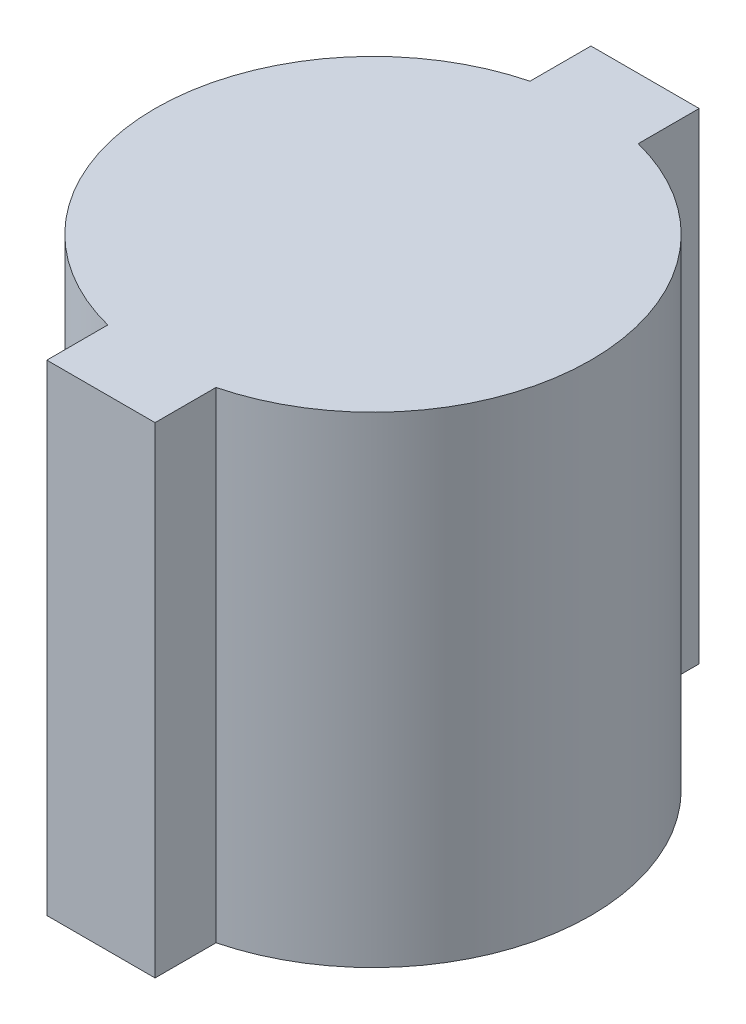
ISO-10303-21;
HEADER;
FILE_DESCRIPTION(('STEP AP214'),'2;1');
FILE_NAME('part.step','',(''),(''),'','','');
FILE_SCHEMA(('AUTOMOTIVE_DESIGN { 1 0 10303 214 1 1 1 1 }'));
ENDSEC;
DATA;
#1=APPLICATION_CONTEXT('core data for automotive mechanical design processes');
#2=APPLICATION_PROTOCOL_DEFINITION('international standard','automotive_design',2000,#1);
#3=PRODUCT_CONTEXT('',#1,'mechanical');
#4=PRODUCT('Part','Part','',(#3));
#5=PRODUCT_RELATED_PRODUCT_CATEGORY('part','',(#4));
#6=PRODUCT_DEFINITION_FORMATION('','',#4);
#7=PRODUCT_DEFINITION_CONTEXT('part definition',#1,'design');
#8=PRODUCT_DEFINITION('design','',#6,#7);
#9=PRODUCT_DEFINITION_SHAPE('','',#8);
#10=(LENGTH_UNIT() NAMED_UNIT(*) SI_UNIT(.MILLI.,.METRE.));
#11=(NAMED_UNIT(*) PLANE_ANGLE_UNIT() SI_UNIT($,.RADIAN.));
#12=(NAMED_UNIT(*) SI_UNIT($,.STERADIAN.) SOLID_ANGLE_UNIT());
#13=UNCERTAINTY_MEASURE_WITH_UNIT(LENGTH_MEASURE(1.E-05),#10,'distance_accuracy_value','');
#14=(GEOMETRIC_REPRESENTATION_CONTEXT(3) GLOBAL_UNCERTAINTY_ASSIGNED_CONTEXT((#13)) GLOBAL_UNIT_ASSIGNED_CONTEXT((#10,
#11,#12)) REPRESENTATION_CONTEXT('',''));
#15=CARTESIAN_POINT('',(0.,0.,0.));
#16=DIRECTION('',(0.,0.,1.));
#17=DIRECTION('',(1.,0.,0.));
#18=AXIS2_PLACEMENT_3D('',#15,#16,#17);
#19=CARTESIAN_POINT('',(0.,20.32,0.));
#20=DIRECTION('',(0.,-1.,0.));
#21=DIRECTION('',(0.,0.,-1.));
#22=AXIS2_PLACEMENT_3D('',#19,#20,#21);
#23=CYLINDRICAL_SURFACE('',#22,9.2075);
#24=CARTESIAN_POINT('',(0.,0.,0.));
#25=DIRECTION('',(0.,1.,0.));
#26=DIRECTION('',(0.,0.,1.));
#27=AXIS2_PLACEMENT_3D('',#24,#25,#26);
#28=CIRCLE('',#27,9.2075);
#29=CARTESIAN_POINT('',(2.286,0.,8.9192073779008));
#30=VERTEX_POINT('',#29);
#31=CARTESIAN_POINT('',(2.286,0.,-8.9192073779008));
#32=VERTEX_POINT('',#31);
#33=EDGE_CURVE('E152',#30,#32,#28,.T.);
#34=ORIENTED_EDGE('',*,*,#33,.T.);
#35=DIRECTION('',(0.,-1.,0.));
#36=VECTOR('',#35,1.);
#37=CARTESIAN_POINT('',(2.286,20.32,-8.9192073779008));
#38=LINE('',#37,#36);
#39=CARTESIAN_POINT('',(2.286,20.32,-8.9192073779008));
#40=VERTEX_POINT('',#39);
#41=EDGE_CURVE('E11',#40,#32,#38,.T.);
#42=ORIENTED_EDGE('',*,*,#41,.F.);
#43=CARTESIAN_POINT('',(0.,20.32,0.));
#44=DIRECTION('',(0.,1.,0.));
#45=DIRECTION('',(0.,0.,1.));
#46=AXIS2_PLACEMENT_3D('',#43,#44,#45);
#47=CIRCLE('',#46,9.2075);
#48=CARTESIAN_POINT('',(2.286,20.32,8.9192073779008));
#49=VERTEX_POINT('',#48);
#50=EDGE_CURVE('E145',#49,#40,#47,.T.);
#51=ORIENTED_EDGE('',*,*,#50,.F.);
#52=DIRECTION('',(0.,-1.,0.));
#53=VECTOR('',#52,1.);
#54=CARTESIAN_POINT('',(2.286,20.32,8.9192073779008));
#55=LINE('',#54,#53);
#56=EDGE_CURVE('E151',#49,#30,#55,.T.);
#57=ORIENTED_EDGE('',*,*,#56,.T.);
#58=EDGE_LOOP('',(#34,#42,#51,#57));
#59=FACE_BOUND('',#58,.T.);
#60=ADVANCED_FACE('F45',(#59),#23,.T.);
#61=CARTESIAN_POINT('',(2.286,20.32,0.));
#62=DIRECTION('',(-1.,0.,0.));
#63=DIRECTION('',(0.,0.,1.));
#64=AXIS2_PLACEMENT_3D('',#61,#62,#63);
#65=PLANE('',#64);
#66=DIRECTION('',(0.,0.,-1.));
#67=VECTOR('',#66,1.);
#68=CARTESIAN_POINT('',(2.286,0.,0.));
#69=LINE('',#68,#67);
#70=CARTESIAN_POINT('',(2.286,0.,-11.4935));
#71=VERTEX_POINT('',#70);
#72=EDGE_CURVE('E156',#32,#71,#69,.T.);
#73=ORIENTED_EDGE('',*,*,#72,.T.);
#74=DIRECTION('',(0.,-1.,0.));
#75=VECTOR('',#74,1.);
#76=CARTESIAN_POINT('',(2.286,20.32,-11.4935));
#77=LINE('',#76,#75);
#78=CARTESIAN_POINT('',(2.286,20.32,-11.4935));
#79=VERTEX_POINT('',#78);
#80=EDGE_CURVE('E55',#79,#71,#77,.T.);
#81=ORIENTED_EDGE('',*,*,#80,.F.);
#82=DIRECTION('',(0.,0.,-1.));
#83=VECTOR('',#82,1.);
#84=CARTESIAN_POINT('',(2.286,20.32,0.));
#85=LINE('',#84,#83);
#86=EDGE_CURVE('E105',#40,#79,#85,.T.);
#87=ORIENTED_EDGE('',*,*,#86,.F.);
#88=ORIENTED_EDGE('',*,*,#41,.T.);
#89=EDGE_LOOP('',(#73,#81,#87,#88));
#90=FACE_BOUND('',#89,.T.);
#91=ADVANCED_FACE('F47',(#90),#65,.F.);
#92=CARTESIAN_POINT('',(0.,20.32,-11.4935));
#93=DIRECTION('',(0.,0.,-1.));
#94=DIRECTION('',(-1.,0.,0.));
#95=AXIS2_PLACEMENT_3D('',#92,#93,#94);
#96=PLANE('',#95);
#97=DIRECTION('',(1.,0.,0.));
#98=VECTOR('',#97,1.);
#99=CARTESIAN_POINT('',(0.,0.,-11.4935));
#100=LINE('',#99,#98);
#101=CARTESIAN_POINT('',(-2.286,0.,-11.4935));
#102=VERTEX_POINT('',#101);
#103=EDGE_CURVE('E161',#102,#71,#100,.T.);
#104=ORIENTED_EDGE('',*,*,#103,.F.);
#105=DIRECTION('',(0.,-1.,0.));
#106=VECTOR('',#105,1.);
#107=CARTESIAN_POINT('',(-2.286,20.32,-11.4935));
#108=LINE('',#107,#106);
#109=CARTESIAN_POINT('',(-2.286,20.32,-11.4935));
#110=VERTEX_POINT('',#109);
#111=EDGE_CURVE('E184',#110,#102,#108,.T.);
#112=ORIENTED_EDGE('',*,*,#111,.F.);
#113=DIRECTION('',(1.,0.,0.));
#114=VECTOR('',#113,1.);
#115=CARTESIAN_POINT('',(0.,20.32,-11.4935));
#116=LINE('',#115,#114);
#117=EDGE_CURVE('E192',#110,#79,#116,.T.);
#118=ORIENTED_EDGE('',*,*,#117,.T.);
#119=ORIENTED_EDGE('',*,*,#80,.T.);
#120=EDGE_LOOP('',(#104,#112,#118,#119));
#121=FACE_BOUND('',#120,.T.);
#122=ADVANCED_FACE('F190',(#121),#96,.T.);
#123=CARTESIAN_POINT('',(-2.286,20.32,0.));
#124=DIRECTION('',(-1.,0.,0.));
#125=DIRECTION('',(0.,0.,1.));
#126=AXIS2_PLACEMENT_3D('',#123,#124,#125);
#127=PLANE('',#126);
#128=DIRECTION('',(0.,0.,-1.));
#129=VECTOR('',#128,1.);
#130=CARTESIAN_POINT('',(-2.286,0.,0.));
#131=LINE('',#130,#129);
#132=CARTESIAN_POINT('',(-2.286,0.,-8.9192073779008));
#133=VERTEX_POINT('',#132);
#134=EDGE_CURVE('E165',#133,#102,#131,.T.);
#135=ORIENTED_EDGE('',*,*,#134,.F.);
#136=DIRECTION('',(0.,-1.,0.));
#137=VECTOR('',#136,1.);
#138=CARTESIAN_POINT('',(-2.286,20.32,-8.9192073779008));
#139=LINE('',#138,#137);
#140=CARTESIAN_POINT('',(-2.286,20.32,-8.9192073779008));
#141=VERTEX_POINT('',#140);
#142=EDGE_CURVE('E181',#141,#133,#139,.T.);
#143=ORIENTED_EDGE('',*,*,#142,.F.);
#144=DIRECTION('',(0.,0.,-1.));
#145=VECTOR('',#144,1.);
#146=CARTESIAN_POINT('',(-2.286,20.32,0.));
#147=LINE('',#146,#145);
#148=EDGE_CURVE('E143',#141,#110,#147,.T.);
#149=ORIENTED_EDGE('',*,*,#148,.T.);
#150=ORIENTED_EDGE('',*,*,#111,.T.);
#151=EDGE_LOOP('',(#135,#143,#149,#150));
#152=FACE_BOUND('',#151,.T.);
#153=ADVANCED_FACE('F201',(#152),#127,.T.);
#154=CARTESIAN_POINT('',(-2.286,0.,8.9192073779008));
#155=VERTEX_POINT('',#154);
#156=EDGE_CURVE('E157',#133,#155,#28,.T.);
#157=ORIENTED_EDGE('',*,*,#156,.T.);
#158=DIRECTION('',(0.,-1.,0.));
#159=VECTOR('',#158,1.);
#160=CARTESIAN_POINT('',(-2.286,20.32,8.9192073779008));
#161=LINE('',#160,#159);
#162=CARTESIAN_POINT('',(-2.286,20.32,8.9192073779008));
#163=VERTEX_POINT('',#162);
#164=EDGE_CURVE('E128',#163,#155,#161,.T.);
#165=ORIENTED_EDGE('',*,*,#164,.F.);
#166=EDGE_CURVE('E138',#141,#163,#47,.T.);
#167=ORIENTED_EDGE('',*,*,#166,.F.);
#168=ORIENTED_EDGE('',*,*,#142,.T.);
#169=EDGE_LOOP('',(#157,#165,#167,#168));
#170=FACE_BOUND('',#169,.T.);
#171=ADVANCED_FACE('F222',(#170),#23,.T.);
#172=CARTESIAN_POINT('',(-2.286,20.32,0.));
#173=DIRECTION('',(-1.,0.,0.));
#174=DIRECTION('',(0.,0.,1.));
#175=AXIS2_PLACEMENT_3D('',#172,#173,#174);
#176=PLANE('',#175);
#177=DIRECTION('',(0.,0.,-1.));
#178=VECTOR('',#177,1.);
#179=CARTESIAN_POINT('',(-2.286,0.,0.));
#180=LINE('',#179,#178);
#181=CARTESIAN_POINT('',(-2.286,0.,11.4935));
#182=VERTEX_POINT('',#181);
#183=EDGE_CURVE('E126',#182,#155,#180,.T.);
#184=ORIENTED_EDGE('',*,*,#183,.F.);
#185=DIRECTION('',(0.,-1.,0.));
#186=VECTOR('',#185,1.);
#187=CARTESIAN_POINT('',(-2.286,20.32,11.4935));
#188=LINE('',#187,#186);
#189=CARTESIAN_POINT('',(-2.286,20.32,11.4935));
#190=VERTEX_POINT('',#189);
#191=EDGE_CURVE('E120',#190,#182,#188,.T.);
#192=ORIENTED_EDGE('',*,*,#191,.F.);
#193=DIRECTION('',(0.,0.,-1.));
#194=VECTOR('',#193,1.);
#195=CARTESIAN_POINT('',(-2.286,20.32,0.));
#196=LINE('',#195,#194);
#197=EDGE_CURVE('E124',#190,#163,#196,.T.);
#198=ORIENTED_EDGE('',*,*,#197,.T.);
#199=ORIENTED_EDGE('',*,*,#164,.T.);
#200=EDGE_LOOP('',(#184,#192,#198,#199));
#201=FACE_BOUND('',#200,.T.);
#202=ADVANCED_FACE('F122',(#201),#176,.T.);
#203=CARTESIAN_POINT('',(0.,20.32,11.4935));
#204=DIRECTION('',(0.,0.,-1.));
#205=DIRECTION('',(-1.,0.,0.));
#206=AXIS2_PLACEMENT_3D('',#203,#204,#205);
#207=PLANE('',#206);
#208=DIRECTION('',(1.,0.,0.));
#209=VECTOR('',#208,1.);
#210=CARTESIAN_POINT('',(0.,0.,11.4935));
#211=LINE('',#210,#209);
#212=CARTESIAN_POINT('',(2.286,0.,11.4935));
#213=VERTEX_POINT('',#212);
#214=EDGE_CURVE('E91',#182,#213,#211,.T.);
#215=ORIENTED_EDGE('',*,*,#214,.T.);
#216=DIRECTION('',(0.,-1.,0.));
#217=VECTOR('',#216,1.);
#218=CARTESIAN_POINT('',(2.286,20.32,11.4935));
#219=LINE('',#218,#217);
#220=CARTESIAN_POINT('',(2.286,20.32,11.4935));
#221=VERTEX_POINT('',#220);
#222=EDGE_CURVE('E129',#221,#213,#219,.T.);
#223=ORIENTED_EDGE('',*,*,#222,.F.);
#224=DIRECTION('',(1.,0.,0.));
#225=VECTOR('',#224,1.);
#226=CARTESIAN_POINT('',(0.,20.32,11.4935));
#227=LINE('',#226,#225);
#228=EDGE_CURVE('E131',#190,#221,#227,.T.);
#229=ORIENTED_EDGE('',*,*,#228,.F.);
#230=ORIENTED_EDGE('',*,*,#191,.T.);
#231=EDGE_LOOP('',(#215,#223,#229,#230));
#232=FACE_BOUND('',#231,.T.);
#233=ADVANCED_FACE('F132',(#232),#207,.F.);
#234=CARTESIAN_POINT('',(2.286,20.32,0.));
#235=DIRECTION('',(-1.,0.,0.));
#236=DIRECTION('',(0.,0.,1.));
#237=AXIS2_PLACEMENT_3D('',#234,#235,#236);
#238=PLANE('',#237);
#239=DIRECTION('',(0.,0.,-1.));
#240=VECTOR('',#239,1.);
#241=CARTESIAN_POINT('',(2.286,0.,0.));
#242=LINE('',#241,#240);
#243=EDGE_CURVE('E97',#213,#30,#242,.T.);
#244=ORIENTED_EDGE('',*,*,#243,.T.);
#245=ORIENTED_EDGE('',*,*,#56,.F.);
#246=DIRECTION('',(0.,0.,-1.));
#247=VECTOR('',#246,1.);
#248=CARTESIAN_POINT('',(2.286,20.32,0.));
#249=LINE('',#248,#247);
#250=EDGE_CURVE('E63',#221,#49,#249,.T.);
#251=ORIENTED_EDGE('',*,*,#250,.F.);
#252=ORIENTED_EDGE('',*,*,#222,.T.);
#253=EDGE_LOOP('',(#244,#245,#251,#252));
#254=FACE_BOUND('',#253,.T.);
#255=ADVANCED_FACE('F210',(#254),#238,.F.);
#256=CARTESIAN_POINT('',(0.,20.32,0.));
#257=DIRECTION('',(0.,1.,0.));
#258=DIRECTION('',(0.,0.,1.));
#259=AXIS2_PLACEMENT_3D('',#256,#257,#258);
#260=PLANE('',#259);
#261=ORIENTED_EDGE('',*,*,#50,.T.);
#262=ORIENTED_EDGE('',*,*,#86,.T.);
#263=ORIENTED_EDGE('',*,*,#117,.F.);
#264=ORIENTED_EDGE('',*,*,#148,.F.);
#265=ORIENTED_EDGE('',*,*,#166,.T.);
#266=ORIENTED_EDGE('',*,*,#197,.F.);
#267=ORIENTED_EDGE('',*,*,#228,.T.);
#268=ORIENTED_EDGE('',*,*,#250,.T.);
#269=EDGE_LOOP('',(#261,#262,#263,#264,#265,#266,#267,#268));
#270=FACE_BOUND('',#269,.T.);
#271=ADVANCED_FACE('F135',(#270),#260,.T.);
#272=CARTESIAN_POINT('',(0.,0.,0.));
#273=DIRECTION('',(0.,1.,0.));
#274=DIRECTION('',(0.,0.,1.));
#275=AXIS2_PLACEMENT_3D('',#272,#273,#274);
#276=PLANE('',#275);
#277=ORIENTED_EDGE('',*,*,#33,.F.);
#278=ORIENTED_EDGE('',*,*,#243,.F.);
#279=ORIENTED_EDGE('',*,*,#214,.F.);
#280=ORIENTED_EDGE('',*,*,#183,.T.);
#281=ORIENTED_EDGE('',*,*,#156,.F.);
#282=ORIENTED_EDGE('',*,*,#134,.T.);
#283=ORIENTED_EDGE('',*,*,#103,.T.);
#284=ORIENTED_EDGE('',*,*,#72,.F.);
#285=EDGE_LOOP('',(#277,#278,#279,#280,#281,#282,#283,#284));
#286=FACE_BOUND('',#285,.T.);
#287=ADVANCED_FACE('F196',(#286),#276,.F.);
#288=CLOSED_SHELL('',(#60,#91,#122,#153,#171,#202,#233,#255,#271,#287));
#289=MANIFOLD_SOLID_BREP('B2',#288);
#290=ADVANCED_BREP_SHAPE_REPRESENTATION('',(#18,#289),#14);
#291=SHAPE_DEFINITION_REPRESENTATION(#9,#290);
ENDSEC;
END-ISO-10303-21;
